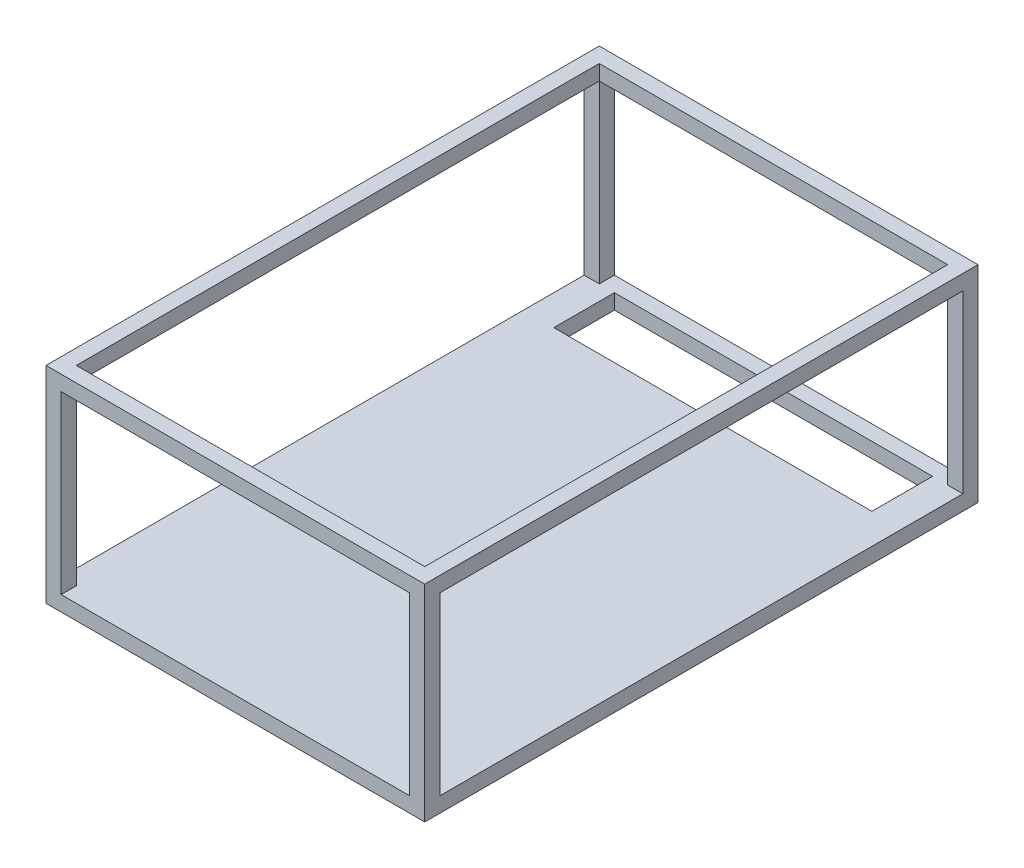
ISO-10303-21;
HEADER;
FILE_DESCRIPTION(('STEP AP214'),'2;1');
FILE_NAME('part.step','',(''),(''),'','','');
FILE_SCHEMA(('AUTOMOTIVE_DESIGN { 1 0 10303 214 1 1 1 1 }'));
ENDSEC;
DATA;
#1=APPLICATION_CONTEXT('core data for automotive mechanical design processes');
#2=APPLICATION_PROTOCOL_DEFINITION('international standard','automotive_design',2000,#1);
#3=PRODUCT_CONTEXT('',#1,'mechanical');
#4=PRODUCT('Part','Part','',(#3));
#5=PRODUCT_RELATED_PRODUCT_CATEGORY('part','',(#4));
#6=PRODUCT_DEFINITION_FORMATION('','',#4);
#7=PRODUCT_DEFINITION_CONTEXT('part definition',#1,'design');
#8=PRODUCT_DEFINITION('design','',#6,#7);
#9=PRODUCT_DEFINITION_SHAPE('','',#8);
#10=(LENGTH_UNIT() NAMED_UNIT(*) SI_UNIT(.MILLI.,.METRE.));
#11=(NAMED_UNIT(*) PLANE_ANGLE_UNIT() SI_UNIT($,.RADIAN.));
#12=(NAMED_UNIT(*) SI_UNIT($,.STERADIAN.) SOLID_ANGLE_UNIT());
#13=UNCERTAINTY_MEASURE_WITH_UNIT(LENGTH_MEASURE(1.E-05),#10,'distance_accuracy_value','');
#14=(GEOMETRIC_REPRESENTATION_CONTEXT(3) GLOBAL_UNCERTAINTY_ASSIGNED_CONTEXT((#13)) GLOBAL_UNIT_ASSIGNED_CONTEXT((#10,
#11,#12)) REPRESENTATION_CONTEXT('',''));
#15=CARTESIAN_POINT('',(0.,0.,0.));
#16=DIRECTION('',(0.,0.,1.));
#17=DIRECTION('',(1.,0.,0.));
#18=AXIS2_PLACEMENT_3D('',#15,#16,#17);
#19=CARTESIAN_POINT('',(-62.5,29.,4.99999999999998));
#20=DIRECTION('',(0.,1.,0.));
#21=DIRECTION('',(0.,0.,1.));
#22=AXIS2_PLACEMENT_3D('',#19,#20,#21);
#23=PLANE('',#22);
#24=DIRECTION('',(1.,0.,0.));
#25=VECTOR('',#24,1.);
#26=CARTESIAN_POINT('',(-62.5,29.,177.6));
#27=LINE('',#26,#25);
#28=CARTESIAN_POINT('',(57.5,29.,177.6));
#29=VERTEX_POINT('',#28);
#30=CARTESIAN_POINT('',(62.5,29.,177.6));
#31=VERTEX_POINT('',#30);
#32=EDGE_CURVE('E333',#29,#31,#27,.T.);
#33=ORIENTED_EDGE('',*,*,#32,.F.);
#34=DIRECTION('',(0.,0.,-1.));
#35=VECTOR('',#34,1.);
#36=CARTESIAN_POINT('',(57.5,29.,4.99999999999998));
#37=LINE('',#36,#35);
#38=CARTESIAN_POINT('',(57.5,29.,5.));
#39=VERTEX_POINT('',#38);
#40=EDGE_CURVE('E252',#29,#39,#37,.T.);
#41=ORIENTED_EDGE('',*,*,#40,.T.);
#42=DIRECTION('',(1.,0.,0.));
#43=VECTOR('',#42,1.);
#44=CARTESIAN_POINT('',(-62.5,29.,4.99999999999998));
#45=LINE('',#44,#43);
#46=CARTESIAN_POINT('',(62.5,29.,4.99999999999998));
#47=VERTEX_POINT('',#46);
#48=EDGE_CURVE('E337',#39,#47,#45,.T.);
#49=ORIENTED_EDGE('',*,*,#48,.T.);
#50=DIRECTION('',(0.,0.,1.));
#51=VECTOR('',#50,1.);
#52=CARTESIAN_POINT('',(62.5,29.,4.99999999999998));
#53=LINE('',#52,#51);
#54=EDGE_CURVE('E309',#47,#31,#53,.T.);
#55=ORIENTED_EDGE('',*,*,#54,.T.);
#56=EDGE_LOOP('',(#33,#41,#49,#55));
#57=FACE_BOUND('',#56,.T.);
#58=ADVANCED_FACE('F38',(#57),#23,.F.);
#59=DIRECTION('',(0.,0.,-1.));
#60=VECTOR('',#59,1.);
#61=CARTESIAN_POINT('',(-57.5,29.,182.6));
#62=LINE('',#61,#60);
#63=CARTESIAN_POINT('',(-57.5,29.,182.6));
#64=VERTEX_POINT('',#63);
#65=CARTESIAN_POINT('',(-57.5,29.,177.6));
#66=VERTEX_POINT('',#65);
#67=EDGE_CURVE('E284',#64,#66,#62,.T.);
#68=ORIENTED_EDGE('',*,*,#67,.T.);
#69=DIRECTION('',(1.,0.,0.));
#70=VECTOR('',#69,1.);
#71=CARTESIAN_POINT('',(-62.5,29.,177.6));
#72=LINE('',#71,#70);
#73=EDGE_CURVE('E237',#66,#29,#72,.T.);
#74=ORIENTED_EDGE('',*,*,#73,.T.);
#75=DIRECTION('',(0.,0.,-1.));
#76=VECTOR('',#75,1.);
#77=CARTESIAN_POINT('',(57.5,29.,182.6));
#78=LINE('',#77,#76);
#79=CARTESIAN_POINT('',(57.5,29.,182.6));
#80=VERTEX_POINT('',#79);
#81=EDGE_CURVE('E279',#80,#29,#78,.T.);
#82=ORIENTED_EDGE('',*,*,#81,.F.);
#83=DIRECTION('',(1.,0.,0.));
#84=VECTOR('',#83,1.);
#85=CARTESIAN_POINT('',(-57.5,29.,182.6));
#86=LINE('',#85,#84);
#87=EDGE_CURVE('E266',#64,#80,#86,.T.);
#88=ORIENTED_EDGE('',*,*,#87,.F.);
#89=EDGE_LOOP('',(#68,#74,#82,#88));
#90=FACE_BOUND('',#89,.T.);
#91=ADVANCED_FACE('F399',(#90),#23,.F.);
#92=CARTESIAN_POINT('',(-62.5,29.,4.99999999999998));
#93=VERTEX_POINT('',#92);
#94=CARTESIAN_POINT('',(-57.5,29.,4.99999999999998));
#95=VERTEX_POINT('',#94);
#96=EDGE_CURVE('E334',#93,#95,#45,.T.);
#97=ORIENTED_EDGE('',*,*,#96,.T.);
#98=DIRECTION('',(0.,0.,1.));
#99=VECTOR('',#98,1.);
#100=CARTESIAN_POINT('',(-57.5,29.,4.99999999999998));
#101=LINE('',#100,#99);
#102=EDGE_CURVE('E249',#95,#66,#101,.T.);
#103=ORIENTED_EDGE('',*,*,#102,.T.);
#104=CARTESIAN_POINT('',(-62.5,29.,177.6));
#105=VERTEX_POINT('',#104);
#106=EDGE_CURVE('E329',#105,#66,#27,.T.);
#107=ORIENTED_EDGE('',*,*,#106,.F.);
#108=DIRECTION('',(0.,0.,1.));
#109=VECTOR('',#108,1.);
#110=CARTESIAN_POINT('',(-62.5,29.,4.99999999999998));
#111=LINE('',#110,#109);
#112=EDGE_CURVE('E315',#93,#105,#111,.T.);
#113=ORIENTED_EDGE('',*,*,#112,.F.);
#114=EDGE_LOOP('',(#97,#103,#107,#113));
#115=FACE_BOUND('',#114,.T.);
#116=ADVANCED_FACE('F406',(#115),#23,.F.);
#117=CARTESIAN_POINT('',(-62.5,-29.,177.6));
#118=DIRECTION('',(0.,0.,1.));
#119=DIRECTION('',(1.,0.,0.));
#120=AXIS2_PLACEMENT_3D('',#117,#118,#119);
#121=PLANE('',#120);
#122=DIRECTION('',(1.,0.,0.));
#123=VECTOR('',#122,1.);
#124=CARTESIAN_POINT('',(-62.5,-29.,177.6));
#125=LINE('',#124,#123);
#126=CARTESIAN_POINT('',(57.5,-29.,177.6));
#127=VERTEX_POINT('',#126);
#128=CARTESIAN_POINT('',(62.5,-29.,177.6));
#129=VERTEX_POINT('',#128);
#130=EDGE_CURVE('E318',#127,#129,#125,.T.);
#131=ORIENTED_EDGE('',*,*,#130,.F.);
#132=DIRECTION('',(0.,1.,0.));
#133=VECTOR('',#132,1.);
#134=CARTESIAN_POINT('',(57.5,-29.,177.6));
#135=LINE('',#134,#133);
#136=EDGE_CURVE('E301',#127,#29,#135,.T.);
#137=ORIENTED_EDGE('',*,*,#136,.T.);
#138=ORIENTED_EDGE('',*,*,#32,.T.);
#139=DIRECTION('',(0.,-1.,0.));
#140=VECTOR('',#139,1.);
#141=CARTESIAN_POINT('',(62.5,-29.,177.6));
#142=LINE('',#141,#140);
#143=EDGE_CURVE('E304',#31,#129,#142,.T.);
#144=ORIENTED_EDGE('',*,*,#143,.T.);
#145=EDGE_LOOP('',(#131,#137,#138,#144));
#146=FACE_BOUND('',#145,.T.);
#147=ADVANCED_FACE('F423',(#146),#121,.F.);
#148=CARTESIAN_POINT('',(-62.5,-29.,4.99999999999998));
#149=DIRECTION('',(0.,0.,-1.));
#150=DIRECTION('',(-1.,0.,0.));
#151=AXIS2_PLACEMENT_3D('',#148,#149,#150);
#152=PLANE('',#151);
#153=ORIENTED_EDGE('',*,*,#48,.F.);
#154=DIRECTION('',(0.,-1.,0.));
#155=VECTOR('',#154,1.);
#156=CARTESIAN_POINT('',(57.5,-29.,4.99999999999998));
#157=LINE('',#156,#155);
#158=CARTESIAN_POINT('',(57.5,-29.,4.99999999999998));
#159=VERTEX_POINT('',#158);
#160=EDGE_CURVE('E298',#39,#159,#157,.T.);
#161=ORIENTED_EDGE('',*,*,#160,.T.);
#162=DIRECTION('',(1.,0.,0.));
#163=VECTOR('',#162,1.);
#164=CARTESIAN_POINT('',(-62.5,-29.,4.99999999999998));
#165=LINE('',#164,#163);
#166=CARTESIAN_POINT('',(62.5,-29.,4.99999999999998));
#167=VERTEX_POINT('',#166);
#168=EDGE_CURVE('E341',#159,#167,#165,.T.);
#169=ORIENTED_EDGE('',*,*,#168,.T.);
#170=DIRECTION('',(0.,1.,0.));
#171=VECTOR('',#170,1.);
#172=CARTESIAN_POINT('',(62.5,-29.,4.99999999999998));
#173=LINE('',#172,#171);
#174=EDGE_CURVE('E324',#167,#47,#173,.T.);
#175=ORIENTED_EDGE('',*,*,#174,.T.);
#176=EDGE_LOOP('',(#153,#161,#169,#175));
#177=FACE_BOUND('',#176,.T.);
#178=ADVANCED_FACE('F395',(#177),#152,.F.);
#179=CARTESIAN_POINT('',(62.5,-34.,182.6));
#180=DIRECTION('',(-1.,0.,0.));
#181=DIRECTION('',(0.,0.,1.));
#182=AXIS2_PLACEMENT_3D('',#179,#180,#181);
#183=PLANE('',#182);
#184=DIRECTION('',(0.,0.,-1.));
#185=VECTOR('',#184,1.);
#186=CARTESIAN_POINT('',(62.5,-29.,4.99999999999998));
#187=LINE('',#186,#185);
#188=EDGE_CURVE('E321',#129,#167,#187,.T.);
#189=ORIENTED_EDGE('',*,*,#188,.F.);
#190=ORIENTED_EDGE('',*,*,#143,.F.);
#191=ORIENTED_EDGE('',*,*,#54,.F.);
#192=ORIENTED_EDGE('',*,*,#174,.F.);
#193=EDGE_LOOP('',(#189,#190,#191,#192));
#194=FACE_BOUND('',#193,.T.);
#195=DIRECTION('',(0.,1.,0.));
#196=VECTOR('',#195,1.);
#197=CARTESIAN_POINT('',(62.5,-34.,0.));
#198=LINE('',#197,#196);
#199=CARTESIAN_POINT('',(62.5,-34.,0.));
#200=VERTEX_POINT('',#199);
#201=CARTESIAN_POINT('',(62.5,34.,0.));
#202=VERTEX_POINT('',#201);
#203=EDGE_CURVE('E332',#200,#202,#198,.T.);
#204=ORIENTED_EDGE('',*,*,#203,.T.);
#205=DIRECTION('',(0.,0.,-1.));
#206=VECTOR('',#205,1.);
#207=CARTESIAN_POINT('',(62.5,34.,182.6));
#208=LINE('',#207,#206);
#209=CARTESIAN_POINT('',(62.5,34.,182.6));
#210=VERTEX_POINT('',#209);
#211=EDGE_CURVE('E11',#210,#202,#208,.T.);
#212=ORIENTED_EDGE('',*,*,#211,.F.);
#213=DIRECTION('',(0.,1.,0.));
#214=VECTOR('',#213,1.);
#215=CARTESIAN_POINT('',(62.5,-34.,182.6));
#216=LINE('',#215,#214);
#217=CARTESIAN_POINT('',(62.5,-34.,182.6));
#218=VERTEX_POINT('',#217);
#219=EDGE_CURVE('E345',#218,#210,#216,.T.);
#220=ORIENTED_EDGE('',*,*,#219,.F.);
#221=DIRECTION('',(0.,0.,-1.));
#222=VECTOR('',#221,1.);
#223=CARTESIAN_POINT('',(62.5,-34.,182.6));
#224=LINE('',#223,#222);
#225=EDGE_CURVE('E355',#218,#200,#224,.T.);
#226=ORIENTED_EDGE('',*,*,#225,.T.);
#227=EDGE_LOOP('',(#204,#212,#220,#226));
#228=FACE_BOUND('',#227,.T.);
#229=ADVANCED_FACE('F40',(#194,#228),#183,.F.);
#230=CARTESIAN_POINT('',(-62.5,34.,182.6));
#231=DIRECTION('',(0.,-1.,0.));
#232=DIRECTION('',(0.,0.,-1.));
#233=AXIS2_PLACEMENT_3D('',#230,#231,#232);
#234=PLANE('',#233);
#235=DIRECTION('',(-1.,0.,0.));
#236=VECTOR('',#235,1.);
#237=CARTESIAN_POINT('',(-57.5,34.,5.));
#238=LINE('',#237,#236);
#239=CARTESIAN_POINT('',(57.5,34.,5.));
#240=VERTEX_POINT('',#239);
#241=CARTESIAN_POINT('',(-57.5,34.,5.));
#242=VERTEX_POINT('',#241);
#243=EDGE_CURVE('E225',#240,#242,#238,.T.);
#244=ORIENTED_EDGE('',*,*,#243,.F.);
#245=DIRECTION('',(0.,0.,-1.));
#246=VECTOR('',#245,1.);
#247=CARTESIAN_POINT('',(57.5,34.,5.));
#248=LINE('',#247,#246);
#249=CARTESIAN_POINT('',(57.5,34.,177.6));
#250=VERTEX_POINT('',#249);
#251=EDGE_CURVE('E220',#250,#240,#248,.T.);
#252=ORIENTED_EDGE('',*,*,#251,.F.);
#253=DIRECTION('',(1.,0.,0.));
#254=VECTOR('',#253,1.);
#255=CARTESIAN_POINT('',(-57.5,34.,177.6));
#256=LINE('',#255,#254);
#257=CARTESIAN_POINT('',(-57.5,34.,177.6));
#258=VERTEX_POINT('',#257);
#259=EDGE_CURVE('E231',#258,#250,#256,.T.);
#260=ORIENTED_EDGE('',*,*,#259,.F.);
#261=DIRECTION('',(0.,0.,1.));
#262=VECTOR('',#261,1.);
#263=CARTESIAN_POINT('',(-57.5,34.,5.));
#264=LINE('',#263,#262);
#265=EDGE_CURVE('E228',#242,#258,#264,.T.);
#266=ORIENTED_EDGE('',*,*,#265,.F.);
#267=EDGE_LOOP('',(#244,#252,#260,#266));
#268=FACE_BOUND('',#267,.T.);
#269=DIRECTION('',(-1.,0.,0.));
#270=VECTOR('',#269,1.);
#271=CARTESIAN_POINT('',(-62.5,34.,0.));
#272=LINE('',#271,#270);
#273=CARTESIAN_POINT('',(-62.5,34.,0.));
#274=VERTEX_POINT('',#273);
#275=EDGE_CURVE('E358',#202,#274,#272,.T.);
#276=ORIENTED_EDGE('',*,*,#275,.T.);
#277=DIRECTION('',(0.,0.,-1.));
#278=VECTOR('',#277,1.);
#279=CARTESIAN_POINT('',(-62.5,34.,182.6));
#280=LINE('',#279,#278);
#281=CARTESIAN_POINT('',(-62.5,34.,182.6));
#282=VERTEX_POINT('',#281);
#283=EDGE_CURVE('E46',#282,#274,#280,.T.);
#284=ORIENTED_EDGE('',*,*,#283,.F.);
#285=DIRECTION('',(-1.,0.,0.));
#286=VECTOR('',#285,1.);
#287=CARTESIAN_POINT('',(-62.5,34.,182.6));
#288=LINE('',#287,#286);
#289=EDGE_CURVE('E348',#210,#282,#288,.T.);
#290=ORIENTED_EDGE('',*,*,#289,.F.);
#291=ORIENTED_EDGE('',*,*,#211,.T.);
#292=EDGE_LOOP('',(#276,#284,#290,#291));
#293=FACE_BOUND('',#292,.T.);
#294=ADVANCED_FACE('F386',(#268,#293),#234,.F.);
#295=CARTESIAN_POINT('',(-62.5,-34.,182.6));
#296=DIRECTION('',(1.,0.,0.));
#297=DIRECTION('',(0.,0.,-1.));
#298=AXIS2_PLACEMENT_3D('',#295,#296,#297);
#299=PLANE('',#298);
#300=ORIENTED_EDGE('',*,*,#112,.T.);
#301=DIRECTION('',(0.,-1.,0.));
#302=VECTOR('',#301,1.);
#303=CARTESIAN_POINT('',(-62.5,-29.,177.6));
#304=LINE('',#303,#302);
#305=CARTESIAN_POINT('',(-62.5,-29.,177.6));
#306=VERTEX_POINT('',#305);
#307=EDGE_CURVE('E305',#105,#306,#304,.T.);
#308=ORIENTED_EDGE('',*,*,#307,.T.);
#309=DIRECTION('',(0.,0.,-1.));
#310=VECTOR('',#309,1.);
#311=CARTESIAN_POINT('',(-62.5,-29.,4.99999999999998));
#312=LINE('',#311,#310);
#313=CARTESIAN_POINT('',(-62.5,-29.,4.99999999999998));
#314=VERTEX_POINT('',#313);
#315=EDGE_CURVE('E308',#306,#314,#312,.T.);
#316=ORIENTED_EDGE('',*,*,#315,.T.);
#317=DIRECTION('',(0.,1.,0.));
#318=VECTOR('',#317,1.);
#319=CARTESIAN_POINT('',(-62.5,-29.,4.99999999999998));
#320=LINE('',#319,#318);
#321=EDGE_CURVE('E312',#314,#93,#320,.T.);
#322=ORIENTED_EDGE('',*,*,#321,.T.);
#323=EDGE_LOOP('',(#300,#308,#316,#322));
#324=FACE_BOUND('',#323,.T.);
#325=DIRECTION('',(0.,-1.,0.));
#326=VECTOR('',#325,1.);
#327=CARTESIAN_POINT('',(-62.5,-34.,0.));
#328=LINE('',#327,#326);
#329=CARTESIAN_POINT('',(-62.5,-34.,0.));
#330=VERTEX_POINT('',#329);
#331=EDGE_CURVE('E360',#274,#330,#328,.T.);
#332=ORIENTED_EDGE('',*,*,#331,.T.);
#333=DIRECTION('',(0.,0.,-1.));
#334=VECTOR('',#333,1.);
#335=CARTESIAN_POINT('',(-62.5,-34.,182.6));
#336=LINE('',#335,#334);
#337=CARTESIAN_POINT('',(-62.5,-34.,182.6));
#338=VERTEX_POINT('',#337);
#339=EDGE_CURVE('E365',#338,#330,#336,.T.);
#340=ORIENTED_EDGE('',*,*,#339,.F.);
#341=DIRECTION('',(0.,-1.,0.));
#342=VECTOR('',#341,1.);
#343=CARTESIAN_POINT('',(-62.5,-34.,182.6));
#344=LINE('',#343,#342);
#345=EDGE_CURVE('E351',#282,#338,#344,.T.);
#346=ORIENTED_EDGE('',*,*,#345,.F.);
#347=ORIENTED_EDGE('',*,*,#283,.T.);
#348=EDGE_LOOP('',(#332,#340,#346,#347));
#349=FACE_BOUND('',#348,.T.);
#350=ADVANCED_FACE('F372',(#324,#349),#299,.F.);
#351=CARTESIAN_POINT('',(-62.5,-34.,182.6));
#352=DIRECTION('',(0.,1.,0.));
#353=DIRECTION('',(0.,0.,1.));
#354=AXIS2_PLACEMENT_3D('',#351,#352,#353);
#355=PLANE('',#354);
#356=DIRECTION('',(1.,0.,0.));
#357=VECTOR('',#356,1.);
#358=CARTESIAN_POINT('',(-52.5,-34.,25.));
#359=LINE('',#358,#357);
#360=CARTESIAN_POINT('',(-52.5,-34.,25.));
#361=VERTEX_POINT('',#360);
#362=CARTESIAN_POINT('',(52.5,-34.,25.));
#363=VERTEX_POINT('',#362);
#364=EDGE_CURVE('E195',#361,#363,#359,.T.);
#365=ORIENTED_EDGE('',*,*,#364,.T.);
#366=DIRECTION('',(0.,0.,-1.));
#367=VECTOR('',#366,1.);
#368=CARTESIAN_POINT('',(52.5,-34.,25.));
#369=LINE('',#368,#367);
#370=CARTESIAN_POINT('',(52.5,-34.,5.));
#371=VERTEX_POINT('',#370);
#372=EDGE_CURVE('E189',#363,#371,#369,.T.);
#373=ORIENTED_EDGE('',*,*,#372,.T.);
#374=DIRECTION('',(-1.,0.,0.));
#375=VECTOR('',#374,1.);
#376=CARTESIAN_POINT('',(-52.5,-34.,5.));
#377=LINE('',#376,#375);
#378=CARTESIAN_POINT('',(-52.5,-34.,5.));
#379=VERTEX_POINT('',#378);
#380=EDGE_CURVE('E198',#371,#379,#377,.T.);
#381=ORIENTED_EDGE('',*,*,#380,.T.);
#382=DIRECTION('',(0.,0.,1.));
#383=VECTOR('',#382,1.);
#384=CARTESIAN_POINT('',(-52.5,-34.,25.));
#385=LINE('',#384,#383);
#386=EDGE_CURVE('E53',#379,#361,#385,.T.);
#387=ORIENTED_EDGE('',*,*,#386,.T.);
#388=EDGE_LOOP('',(#365,#373,#381,#387));
#389=FACE_BOUND('',#388,.T.);
#390=DIRECTION('',(1.,0.,0.));
#391=VECTOR('',#390,1.);
#392=CARTESIAN_POINT('',(-62.5,-34.,0.));
#393=LINE('',#392,#391);
#394=EDGE_CURVE('E349',#330,#200,#393,.T.);
#395=ORIENTED_EDGE('',*,*,#394,.T.);
#396=ORIENTED_EDGE('',*,*,#225,.F.);
#397=DIRECTION('',(1.,0.,0.));
#398=VECTOR('',#397,1.);
#399=CARTESIAN_POINT('',(-62.5,-34.,182.6));
#400=LINE('',#399,#398);
#401=EDGE_CURVE('E353',#338,#218,#400,.T.);
#402=ORIENTED_EDGE('',*,*,#401,.F.);
#403=ORIENTED_EDGE('',*,*,#339,.T.);
#404=EDGE_LOOP('',(#395,#396,#402,#403));
#405=FACE_BOUND('',#404,.T.);
#406=ADVANCED_FACE('F202',(#389,#405),#355,.F.);
#407=CARTESIAN_POINT('',(0.,0.,182.6));
#408=DIRECTION('',(0.,0.,-1.));
#409=DIRECTION('',(-1.,0.,0.));
#410=AXIS2_PLACEMENT_3D('',#407,#408,#409);
#411=PLANE('',#410);
#412=ORIENTED_EDGE('',*,*,#87,.T.);
#413=DIRECTION('',(0.,-1.,0.));
#414=VECTOR('',#413,1.);
#415=CARTESIAN_POINT('',(57.5,-29.,182.6));
#416=LINE('',#415,#414);
#417=CARTESIAN_POINT('',(57.5,-29.,182.6));
#418=VERTEX_POINT('',#417);
#419=EDGE_CURVE('E256',#80,#418,#416,.T.);
#420=ORIENTED_EDGE('',*,*,#419,.T.);
#421=DIRECTION('',(-1.,0.,0.));
#422=VECTOR('',#421,1.);
#423=CARTESIAN_POINT('',(-57.5,-29.,182.6));
#424=LINE('',#423,#422);
#425=CARTESIAN_POINT('',(-57.5,-29.,182.6));
#426=VERTEX_POINT('',#425);
#427=EDGE_CURVE('E259',#418,#426,#424,.T.);
#428=ORIENTED_EDGE('',*,*,#427,.T.);
#429=DIRECTION('',(0.,1.,0.));
#430=VECTOR('',#429,1.);
#431=CARTESIAN_POINT('',(-57.5,-29.,182.6));
#432=LINE('',#431,#430);
#433=EDGE_CURVE('E263',#426,#64,#432,.T.);
#434=ORIENTED_EDGE('',*,*,#433,.T.);
#435=EDGE_LOOP('',(#412,#420,#428,#434));
#436=FACE_BOUND('',#435,.T.);
#437=ORIENTED_EDGE('',*,*,#219,.T.);
#438=ORIENTED_EDGE('',*,*,#289,.T.);
#439=ORIENTED_EDGE('',*,*,#345,.T.);
#440=ORIENTED_EDGE('',*,*,#401,.T.);
#441=EDGE_LOOP('',(#437,#438,#439,#440));
#442=FACE_BOUND('',#441,.T.);
#443=ADVANCED_FACE('F385',(#436,#442),#411,.F.);
#444=CARTESIAN_POINT('',(0.,0.,0.));
#445=DIRECTION('',(0.,0.,-1.));
#446=DIRECTION('',(-1.,0.,0.));
#447=AXIS2_PLACEMENT_3D('',#444,#445,#446);
#448=PLANE('',#447);
#449=DIRECTION('',(0.,-1.,0.));
#450=VECTOR('',#449,1.);
#451=CARTESIAN_POINT('',(57.5,-29.,0.));
#452=LINE('',#451,#450);
#453=CARTESIAN_POINT('',(57.5,29.,0.));
#454=VERTEX_POINT('',#453);
#455=CARTESIAN_POINT('',(57.5,-29.,0.));
#456=VERTEX_POINT('',#455);
#457=EDGE_CURVE('E255',#454,#456,#452,.T.);
#458=ORIENTED_EDGE('',*,*,#457,.F.);
#459=DIRECTION('',(1.,0.,0.));
#460=VECTOR('',#459,1.);
#461=CARTESIAN_POINT('',(-57.5,29.,0.));
#462=LINE('',#461,#460);
#463=CARTESIAN_POINT('',(-57.5,29.,0.));
#464=VERTEX_POINT('',#463);
#465=EDGE_CURVE('E260',#464,#454,#462,.T.);
#466=ORIENTED_EDGE('',*,*,#465,.F.);
#467=DIRECTION('',(0.,1.,0.));
#468=VECTOR('',#467,1.);
#469=CARTESIAN_POINT('',(-57.5,-29.,0.));
#470=LINE('',#469,#468);
#471=CARTESIAN_POINT('',(-57.5,-29.,0.));
#472=VERTEX_POINT('',#471);
#473=EDGE_CURVE('E274',#472,#464,#470,.T.);
#474=ORIENTED_EDGE('',*,*,#473,.F.);
#475=DIRECTION('',(-1.,0.,0.));
#476=VECTOR('',#475,1.);
#477=CARTESIAN_POINT('',(-57.5,-29.,0.));
#478=LINE('',#477,#476);
#479=EDGE_CURVE('E271',#456,#472,#478,.T.);
#480=ORIENTED_EDGE('',*,*,#479,.F.);
#481=EDGE_LOOP('',(#458,#466,#474,#480));
#482=FACE_BOUND('',#481,.T.);
#483=ORIENTED_EDGE('',*,*,#203,.F.);
#484=ORIENTED_EDGE('',*,*,#394,.F.);
#485=ORIENTED_EDGE('',*,*,#331,.F.);
#486=ORIENTED_EDGE('',*,*,#275,.F.);
#487=EDGE_LOOP('',(#483,#484,#485,#486));
#488=FACE_BOUND('',#487,.T.);
#489=ADVANCED_FACE('F378',(#482,#488),#448,.T.);
#490=ORIENTED_EDGE('',*,*,#106,.T.);
#491=DIRECTION('',(0.,-1.,0.));
#492=VECTOR('',#491,1.);
#493=CARTESIAN_POINT('',(-57.5,-29.,177.6));
#494=LINE('',#493,#492);
#495=CARTESIAN_POINT('',(-57.5,-29.,177.6));
#496=VERTEX_POINT('',#495);
#497=EDGE_CURVE('E295',#66,#496,#494,.T.);
#498=ORIENTED_EDGE('',*,*,#497,.T.);
#499=EDGE_CURVE('E342',#306,#496,#125,.T.);
#500=ORIENTED_EDGE('',*,*,#499,.F.);
#501=ORIENTED_EDGE('',*,*,#307,.F.);
#502=EDGE_LOOP('',(#490,#498,#500,#501));
#503=FACE_BOUND('',#502,.T.);
#504=ADVANCED_FACE('F413',(#503),#121,.F.);
#505=EDGE_CURVE('E283',#39,#454,#78,.T.);
#506=ORIENTED_EDGE('',*,*,#505,.F.);
#507=DIRECTION('',(-1.,0.,0.));
#508=VECTOR('',#507,1.);
#509=CARTESIAN_POINT('',(-62.5,29.,5.));
#510=LINE('',#509,#508);
#511=EDGE_CURVE('E246',#39,#95,#510,.T.);
#512=ORIENTED_EDGE('',*,*,#511,.T.);
#513=EDGE_CURVE('E287',#95,#464,#62,.T.);
#514=ORIENTED_EDGE('',*,*,#513,.T.);
#515=ORIENTED_EDGE('',*,*,#465,.T.);
#516=EDGE_LOOP('',(#506,#512,#514,#515));
#517=FACE_BOUND('',#516,.T.);
#518=ADVANCED_FACE('F402',(#517),#23,.F.);
#519=CARTESIAN_POINT('',(-57.5,-29.,4.99999999999998));
#520=VERTEX_POINT('',#519);
#521=EDGE_CURVE('E338',#314,#520,#165,.T.);
#522=ORIENTED_EDGE('',*,*,#521,.T.);
#523=DIRECTION('',(0.,1.,0.));
#524=VECTOR('',#523,1.);
#525=CARTESIAN_POINT('',(-57.5,-29.,4.99999999999998));
#526=LINE('',#525,#524);
#527=EDGE_CURVE('E282',#520,#95,#526,.T.);
#528=ORIENTED_EDGE('',*,*,#527,.T.);
#529=ORIENTED_EDGE('',*,*,#96,.F.);
#530=ORIENTED_EDGE('',*,*,#321,.F.);
#531=EDGE_LOOP('',(#522,#528,#529,#530));
#532=FACE_BOUND('',#531,.T.);
#533=ADVANCED_FACE('F412',(#532),#152,.F.);
#534=CARTESIAN_POINT('',(-62.5,-29.,4.99999999999998));
#535=DIRECTION('',(0.,-1.,0.));
#536=DIRECTION('',(0.,0.,-1.));
#537=AXIS2_PLACEMENT_3D('',#534,#535,#536);
#538=PLANE('',#537);
#539=DIRECTION('',(-1.,0.,0.));
#540=VECTOR('',#539,1.);
#541=CARTESIAN_POINT('',(-52.5,-29.,5.));
#542=LINE('',#541,#540);
#543=CARTESIAN_POINT('',(52.5,-29.,5.));
#544=VERTEX_POINT('',#543);
#545=CARTESIAN_POINT('',(-52.5,-29.,5.));
#546=VERTEX_POINT('',#545);
#547=EDGE_CURVE('E214',#544,#546,#542,.T.);
#548=ORIENTED_EDGE('',*,*,#547,.F.);
#549=DIRECTION('',(0.,0.,-1.));
#550=VECTOR('',#549,1.);
#551=CARTESIAN_POINT('',(52.5,-29.,25.));
#552=LINE('',#551,#550);
#553=CARTESIAN_POINT('',(52.5,-29.,25.));
#554=VERTEX_POINT('',#553);
#555=EDGE_CURVE('E61',#554,#544,#552,.T.);
#556=ORIENTED_EDGE('',*,*,#555,.F.);
#557=DIRECTION('',(1.,0.,0.));
#558=VECTOR('',#557,1.);
#559=CARTESIAN_POINT('',(-52.5,-29.,25.));
#560=LINE('',#559,#558);
#561=CARTESIAN_POINT('',(-52.5,-29.,25.));
#562=VERTEX_POINT('',#561);
#563=EDGE_CURVE('E205',#562,#554,#560,.T.);
#564=ORIENTED_EDGE('',*,*,#563,.F.);
#565=DIRECTION('',(0.,0.,1.));
#566=VECTOR('',#565,1.);
#567=CARTESIAN_POINT('',(-52.5,-29.,25.));
#568=LINE('',#567,#566);
#569=EDGE_CURVE('E208',#546,#562,#568,.T.);
#570=ORIENTED_EDGE('',*,*,#569,.F.);
#571=EDGE_LOOP('',(#548,#556,#564,#570));
#572=FACE_BOUND('',#571,.T.);
#573=DIRECTION('',(0.,0.,-1.));
#574=VECTOR('',#573,1.);
#575=CARTESIAN_POINT('',(-57.5,-29.,182.6));
#576=LINE('',#575,#574);
#577=EDGE_CURVE('E290',#520,#472,#576,.T.);
#578=ORIENTED_EDGE('',*,*,#577,.F.);
#579=ORIENTED_EDGE('',*,*,#521,.F.);
#580=ORIENTED_EDGE('',*,*,#315,.F.);
#581=ORIENTED_EDGE('',*,*,#499,.T.);
#582=EDGE_CURVE('E288',#426,#496,#576,.T.);
#583=ORIENTED_EDGE('',*,*,#582,.F.);
#584=ORIENTED_EDGE('',*,*,#427,.F.);
#585=DIRECTION('',(0.,0.,-1.));
#586=VECTOR('',#585,1.);
#587=CARTESIAN_POINT('',(57.5,-29.,182.6));
#588=LINE('',#587,#586);
#589=EDGE_CURVE('E291',#418,#127,#588,.T.);
#590=ORIENTED_EDGE('',*,*,#589,.T.);
#591=ORIENTED_EDGE('',*,*,#130,.T.);
#592=ORIENTED_EDGE('',*,*,#188,.T.);
#593=ORIENTED_EDGE('',*,*,#168,.F.);
#594=EDGE_CURVE('E269',#159,#456,#588,.T.);
#595=ORIENTED_EDGE('',*,*,#594,.T.);
#596=ORIENTED_EDGE('',*,*,#479,.T.);
#597=EDGE_LOOP('',(#578,#579,#580,#581,#583,#584,#590,#591,#592,#593,#595,#596));
#598=FACE_BOUND('',#597,.T.);
#599=ADVANCED_FACE('F419',(#572,#598),#538,.F.);
#600=CARTESIAN_POINT('',(-57.5,-29.,182.6));
#601=DIRECTION('',(-1.,0.,0.));
#602=DIRECTION('',(0.,0.,1.));
#603=AXIS2_PLACEMENT_3D('',#600,#601,#602);
#604=PLANE('',#603);
#605=ORIENTED_EDGE('',*,*,#577,.T.);
#606=ORIENTED_EDGE('',*,*,#473,.T.);
#607=ORIENTED_EDGE('',*,*,#513,.F.);
#608=ORIENTED_EDGE('',*,*,#527,.F.);
#609=EDGE_LOOP('',(#605,#606,#607,#608));
#610=FACE_BOUND('',#609,.T.);
#611=ADVANCED_FACE('F438',(#610),#604,.F.);
#612=CARTESIAN_POINT('',(57.5,-29.,182.6));
#613=DIRECTION('',(1.,0.,0.));
#614=DIRECTION('',(0.,0.,-1.));
#615=AXIS2_PLACEMENT_3D('',#612,#613,#614);
#616=PLANE('',#615);
#617=ORIENTED_EDGE('',*,*,#505,.T.);
#618=ORIENTED_EDGE('',*,*,#457,.T.);
#619=ORIENTED_EDGE('',*,*,#594,.F.);
#620=ORIENTED_EDGE('',*,*,#160,.F.);
#621=EDGE_LOOP('',(#617,#618,#619,#620));
#622=FACE_BOUND('',#621,.T.);
#623=ADVANCED_FACE('F452',(#622),#616,.F.);
#624=ORIENTED_EDGE('',*,*,#589,.F.);
#625=ORIENTED_EDGE('',*,*,#419,.F.);
#626=ORIENTED_EDGE('',*,*,#81,.T.);
#627=ORIENTED_EDGE('',*,*,#136,.F.);
#628=EDGE_LOOP('',(#624,#625,#626,#627));
#629=FACE_BOUND('',#628,.T.);
#630=ADVANCED_FACE('F465',(#629),#616,.F.);
#631=ORIENTED_EDGE('',*,*,#67,.F.);
#632=ORIENTED_EDGE('',*,*,#433,.F.);
#633=ORIENTED_EDGE('',*,*,#582,.T.);
#634=ORIENTED_EDGE('',*,*,#497,.F.);
#635=EDGE_LOOP('',(#631,#632,#633,#634));
#636=FACE_BOUND('',#635,.T.);
#637=ADVANCED_FACE('F483',(#636),#604,.F.);
#638=CARTESIAN_POINT('',(57.5,-29.,5.));
#639=DIRECTION('',(1.,0.,0.));
#640=DIRECTION('',(0.,0.,-1.));
#641=AXIS2_PLACEMENT_3D('',#638,#639,#640);
#642=PLANE('',#641);
#643=DIRECTION('',(0.,1.,0.));
#644=VECTOR('',#643,1.);
#645=CARTESIAN_POINT('',(57.5,-29.,177.6));
#646=LINE('',#645,#644);
#647=EDGE_CURVE('E235',#29,#250,#646,.T.);
#648=ORIENTED_EDGE('',*,*,#647,.T.);
#649=ORIENTED_EDGE('',*,*,#251,.T.);
#650=DIRECTION('',(0.,1.,0.));
#651=VECTOR('',#650,1.);
#652=CARTESIAN_POINT('',(57.5,-29.,5.));
#653=LINE('',#652,#651);
#654=EDGE_CURVE('E234',#39,#240,#653,.T.);
#655=ORIENTED_EDGE('',*,*,#654,.F.);
#656=ORIENTED_EDGE('',*,*,#40,.F.);
#657=EDGE_LOOP('',(#648,#649,#655,#656));
#658=FACE_BOUND('',#657,.T.);
#659=ADVANCED_FACE('F447',(#658),#642,.F.);
#660=CARTESIAN_POINT('',(-57.5,-29.,5.));
#661=DIRECTION('',(-1.,0.,0.));
#662=DIRECTION('',(0.,0.,1.));
#663=AXIS2_PLACEMENT_3D('',#660,#661,#662);
#664=PLANE('',#663);
#665=DIRECTION('',(0.,1.,0.));
#666=VECTOR('',#665,1.);
#667=CARTESIAN_POINT('',(-57.5,-29.,5.));
#668=LINE('',#667,#666);
#669=EDGE_CURVE('E240',#95,#242,#668,.T.);
#670=ORIENTED_EDGE('',*,*,#669,.T.);
#671=ORIENTED_EDGE('',*,*,#265,.T.);
#672=DIRECTION('',(0.,1.,0.));
#673=VECTOR('',#672,1.);
#674=CARTESIAN_POINT('',(-57.5,-29.,177.6));
#675=LINE('',#674,#673);
#676=EDGE_CURVE('E238',#66,#258,#675,.T.);
#677=ORIENTED_EDGE('',*,*,#676,.F.);
#678=ORIENTED_EDGE('',*,*,#102,.F.);
#679=EDGE_LOOP('',(#670,#671,#677,#678));
#680=FACE_BOUND('',#679,.T.);
#681=ADVANCED_FACE('F473',(#680),#664,.F.);
#682=CARTESIAN_POINT('',(-57.5,-29.,5.));
#683=DIRECTION('',(0.,0.,-1.));
#684=DIRECTION('',(-1.,0.,0.));
#685=AXIS2_PLACEMENT_3D('',#682,#683,#684);
#686=PLANE('',#685);
#687=ORIENTED_EDGE('',*,*,#654,.T.);
#688=ORIENTED_EDGE('',*,*,#243,.T.);
#689=ORIENTED_EDGE('',*,*,#669,.F.);
#690=ORIENTED_EDGE('',*,*,#511,.F.);
#691=EDGE_LOOP('',(#687,#688,#689,#690));
#692=FACE_BOUND('',#691,.T.);
#693=ADVANCED_FACE('F445',(#692),#686,.F.);
#694=CARTESIAN_POINT('',(-57.5,-29.,177.6));
#695=DIRECTION('',(0.,0.,1.));
#696=DIRECTION('',(1.,0.,0.));
#697=AXIS2_PLACEMENT_3D('',#694,#695,#696);
#698=PLANE('',#697);
#699=ORIENTED_EDGE('',*,*,#676,.T.);
#700=ORIENTED_EDGE('',*,*,#259,.T.);
#701=ORIENTED_EDGE('',*,*,#647,.F.);
#702=ORIENTED_EDGE('',*,*,#73,.F.);
#703=EDGE_LOOP('',(#699,#700,#701,#702));
#704=FACE_BOUND('',#703,.T.);
#705=ADVANCED_FACE('F471',(#704),#698,.F.);
#706=CARTESIAN_POINT('',(52.5,-34.,25.));
#707=DIRECTION('',(1.,0.,0.));
#708=DIRECTION('',(0.,0.,-1.));
#709=AXIS2_PLACEMENT_3D('',#706,#707,#708);
#710=PLANE('',#709);
#711=ORIENTED_EDGE('',*,*,#555,.T.);
#712=DIRECTION('',(0.,1.,0.));
#713=VECTOR('',#712,1.);
#714=CARTESIAN_POINT('',(52.5,-34.,5.));
#715=LINE('',#714,#713);
#716=EDGE_CURVE('E185',#371,#544,#715,.T.);
#717=ORIENTED_EDGE('',*,*,#716,.F.);
#718=ORIENTED_EDGE('',*,*,#372,.F.);
#719=DIRECTION('',(0.,1.,0.));
#720=VECTOR('',#719,1.);
#721=CARTESIAN_POINT('',(52.5,-34.,25.));
#722=LINE('',#721,#720);
#723=EDGE_CURVE('E218',#363,#554,#722,.T.);
#724=ORIENTED_EDGE('',*,*,#723,.T.);
#725=EDGE_LOOP('',(#711,#717,#718,#724));
#726=FACE_BOUND('',#725,.T.);
#727=ADVANCED_FACE('F187',(#726),#710,.F.);
#728=CARTESIAN_POINT('',(-52.5,-34.,25.));
#729=DIRECTION('',(0.,0.,1.));
#730=DIRECTION('',(1.,0.,0.));
#731=AXIS2_PLACEMENT_3D('',#728,#729,#730);
#732=PLANE('',#731);
#733=ORIENTED_EDGE('',*,*,#563,.T.);
#734=ORIENTED_EDGE('',*,*,#723,.F.);
#735=ORIENTED_EDGE('',*,*,#364,.F.);
#736=DIRECTION('',(0.,1.,0.));
#737=VECTOR('',#736,1.);
#738=CARTESIAN_POINT('',(-52.5,-34.,25.));
#739=LINE('',#738,#737);
#740=EDGE_CURVE('E221',#361,#562,#739,.T.);
#741=ORIENTED_EDGE('',*,*,#740,.T.);
#742=EDGE_LOOP('',(#733,#734,#735,#741));
#743=FACE_BOUND('',#742,.T.);
#744=ADVANCED_FACE('F607',(#743),#732,.F.);
#745=CARTESIAN_POINT('',(-52.5,-34.,25.));
#746=DIRECTION('',(-1.,0.,0.));
#747=DIRECTION('',(0.,0.,1.));
#748=AXIS2_PLACEMENT_3D('',#745,#746,#747);
#749=PLANE('',#748);
#750=ORIENTED_EDGE('',*,*,#569,.T.);
#751=ORIENTED_EDGE('',*,*,#740,.F.);
#752=ORIENTED_EDGE('',*,*,#386,.F.);
#753=DIRECTION('',(0.,1.,0.));
#754=VECTOR('',#753,1.);
#755=CARTESIAN_POINT('',(-52.5,-34.,5.));
#756=LINE('',#755,#754);
#757=EDGE_CURVE('E194',#379,#546,#756,.T.);
#758=ORIENTED_EDGE('',*,*,#757,.T.);
#759=EDGE_LOOP('',(#750,#751,#752,#758));
#760=FACE_BOUND('',#759,.T.);
#761=ADVANCED_FACE('F612',(#760),#749,.F.);
#762=CARTESIAN_POINT('',(-52.5,-34.,5.));
#763=DIRECTION('',(0.,0.,-1.));
#764=DIRECTION('',(-1.,0.,0.));
#765=AXIS2_PLACEMENT_3D('',#762,#763,#764);
#766=PLANE('',#765);
#767=ORIENTED_EDGE('',*,*,#547,.T.);
#768=ORIENTED_EDGE('',*,*,#757,.F.);
#769=ORIENTED_EDGE('',*,*,#380,.F.);
#770=ORIENTED_EDGE('',*,*,#716,.T.);
#771=EDGE_LOOP('',(#767,#768,#769,#770));
#772=FACE_BOUND('',#771,.T.);
#773=ADVANCED_FACE('F199',(#772),#766,.F.);
#774=CLOSED_SHELL('',(#58,#91,#116,#147,#178,#229,#294,#350,#406,#443,#489,#504,#518,#533,#599,
#611,#623,#630,#637,#659,#681,#693,#705,#727,#744,#761,#773));
#775=MANIFOLD_SOLID_BREP('B2',#774);
#776=ADVANCED_BREP_SHAPE_REPRESENTATION('',(#18,#775),#14);
#777=SHAPE_DEFINITION_REPRESENTATION(#9,#776);
ENDSEC;
END-ISO-10303-21;
